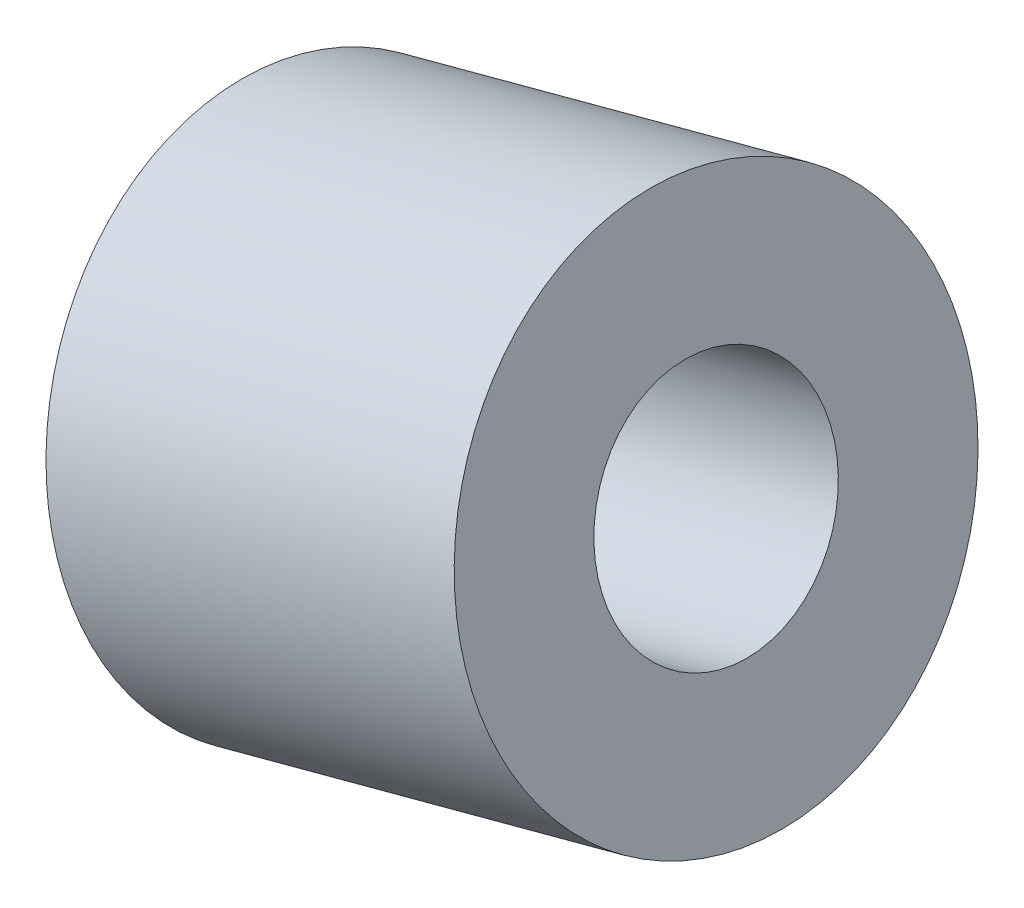
ISO-10303-21;
HEADER;
FILE_DESCRIPTION(('STEP AP214'),'2;1');
FILE_NAME('part.step','',(''),(''),'','','');
FILE_SCHEMA(('AUTOMOTIVE_DESIGN { 1 0 10303 214 1 1 1 1 }'));
ENDSEC;
DATA;
#1=APPLICATION_CONTEXT('core data for automotive mechanical design processes');
#2=APPLICATION_PROTOCOL_DEFINITION('international standard','automotive_design',2000,#1);
#3=PRODUCT_CONTEXT('',#1,'mechanical');
#4=PRODUCT('Part','Part','',(#3));
#5=PRODUCT_RELATED_PRODUCT_CATEGORY('part','',(#4));
#6=PRODUCT_DEFINITION_FORMATION('','',#4);
#7=PRODUCT_DEFINITION_CONTEXT('part definition',#1,'design');
#8=PRODUCT_DEFINITION('design','',#6,#7);
#9=PRODUCT_DEFINITION_SHAPE('','',#8);
#10=(LENGTH_UNIT() NAMED_UNIT(*) SI_UNIT(.MILLI.,.METRE.));
#11=(NAMED_UNIT(*) PLANE_ANGLE_UNIT() SI_UNIT($,.RADIAN.));
#12=(NAMED_UNIT(*) SI_UNIT($,.STERADIAN.) SOLID_ANGLE_UNIT());
#13=UNCERTAINTY_MEASURE_WITH_UNIT(LENGTH_MEASURE(1.E-05),#10,'distance_accuracy_value','');
#14=(GEOMETRIC_REPRESENTATION_CONTEXT(3) GLOBAL_UNCERTAINTY_ASSIGNED_CONTEXT((#13)) GLOBAL_UNIT_ASSIGNED_CONTEXT((#10,
#11,#12)) REPRESENTATION_CONTEXT('',''));
#15=CARTESIAN_POINT('',(0.,0.,0.));
#16=DIRECTION('',(0.,0.,1.));
#17=DIRECTION('',(1.,0.,0.));
#18=AXIS2_PLACEMENT_3D('',#15,#16,#17);
#19=CARTESIAN_POINT('',(-51.9867681997069,-48.929812556218,102.));
#20=DIRECTION('',(0.965925826289068,0.258819045102522,0.));
#21=DIRECTION('',(-0.258819045102522,0.965925826289068,0.));
#22=AXIS2_PLACEMENT_3D('',#19,#20,#21);
#23=CYLINDRICAL_SURFACE('',#22,7.);
#24=CARTESIAN_POINT('',(-51.9867681997069,-48.929812556218,102.));
#25=DIRECTION('',(-0.965925826289068,-0.258819045102522,0.));
#26=DIRECTION('',(0.258819045102522,-0.965925826289068,0.));
#27=AXIS2_PLACEMENT_3D('',#24,#25,#26);
#28=CIRCLE('',#27,7.);
#29=CARTESIAN_POINT('',(-50.1750348839892,-55.6912933402415,102.));
#30=VERTEX_POINT('',#29);
#31=EDGE_CURVE('E41',#30,#30,#28,.T.);
#32=ORIENTED_EDGE('',*,*,#31,.T.);
#33=EDGE_LOOP('',(#32));
#34=FACE_BOUND('',#33,.T.);
#35=CARTESIAN_POINT('',(-27.83862254248,-42.4593364286553,101.999999999999));
#36=DIRECTION('',(-0.965925826289068,-0.258819045102522,0.));
#37=DIRECTION('',(0.258819045102522,-0.965925826289068,0.));
#38=AXIS2_PLACEMENT_3D('',#35,#36,#37);
#39=CIRCLE('',#38,7.);
#40=CARTESIAN_POINT('',(-26.0268892267624,-49.2208172126787,102.));
#41=VERTEX_POINT('',#40);
#42=EDGE_CURVE('E47',#41,#41,#39,.T.);
#43=ORIENTED_EDGE('',*,*,#42,.F.);
#44=EDGE_LOOP('',(#43));
#45=FACE_BOUND('',#44,.T.);
#46=ADVANCED_FACE('F34',(#34,#45),#23,.F.);
#47=CARTESIAN_POINT('',(-51.9867681997069,-48.929812556218,102.));
#48=DIRECTION('',(0.965925826289068,0.258819045102522,0.));
#49=DIRECTION('',(-0.258819045102522,0.965925826289068,0.));
#50=AXIS2_PLACEMENT_3D('',#47,#48,#49);
#51=CYLINDRICAL_SURFACE('',#50,15.);
#52=CARTESIAN_POINT('',(-51.9867681997069,-48.929812556218,102.));
#53=DIRECTION('',(-0.965925826289068,-0.258819045102522,0.));
#54=DIRECTION('',(0.258819045102522,-0.965925826289068,0.));
#55=AXIS2_PLACEMENT_3D('',#52,#53,#54);
#56=CIRCLE('',#55,15.);
#57=CARTESIAN_POINT('',(-48.1044825231691,-63.418699950554,102.));
#58=VERTEX_POINT('',#57);
#59=EDGE_CURVE('E10',#58,#58,#56,.T.);
#60=ORIENTED_EDGE('',*,*,#59,.F.);
#61=EDGE_LOOP('',(#60));
#62=FACE_BOUND('',#61,.T.);
#63=CARTESIAN_POINT('',(-27.83862254248,-42.4593364286553,101.999999999999));
#64=DIRECTION('',(-0.965925826289068,-0.258819045102522,0.));
#65=DIRECTION('',(0.258819045102522,-0.965925826289068,0.));
#66=AXIS2_PLACEMENT_3D('',#63,#64,#65);
#67=CIRCLE('',#66,15.);
#68=CARTESIAN_POINT('',(-23.9563368659422,-56.9482238229913,102.));
#69=VERTEX_POINT('',#68);
#70=EDGE_CURVE('E37',#69,#69,#67,.T.);
#71=ORIENTED_EDGE('',*,*,#70,.T.);
#72=EDGE_LOOP('',(#71));
#73=FACE_BOUND('',#72,.T.);
#74=ADVANCED_FACE('F54',(#62,#73),#51,.T.);
#75=CARTESIAN_POINT('',(-51.9867681997069,-48.929812556218,102.));
#76=DIRECTION('',(-0.965925826289068,-0.258819045102522,0.));
#77=DIRECTION('',(0.258819045102522,-0.965925826289068,0.));
#78=AXIS2_PLACEMENT_3D('',#75,#76,#77);
#79=PLANE('',#78);
#80=ORIENTED_EDGE('',*,*,#31,.F.);
#81=EDGE_LOOP('',(#80));
#82=FACE_BOUND('',#81,.T.);
#83=ORIENTED_EDGE('',*,*,#59,.T.);
#84=EDGE_LOOP('',(#83));
#85=FACE_BOUND('',#84,.T.);
#86=ADVANCED_FACE('F58',(#82,#85),#79,.T.);
#87=CARTESIAN_POINT('',(-27.83862254248,-42.4593364286553,101.999999999999));
#88=DIRECTION('',(-0.965925826289068,-0.258819045102522,0.));
#89=DIRECTION('',(0.258819045102522,-0.965925826289068,0.));
#90=AXIS2_PLACEMENT_3D('',#87,#88,#89);
#91=PLANE('',#90);
#92=ORIENTED_EDGE('',*,*,#42,.T.);
#93=EDGE_LOOP('',(#92));
#94=FACE_BOUND('',#93,.T.);
#95=ORIENTED_EDGE('',*,*,#70,.F.);
#96=EDGE_LOOP('',(#95));
#97=FACE_BOUND('',#96,.T.);
#98=ADVANCED_FACE('F56',(#94,#97),#91,.F.);
#99=CLOSED_SHELL('',(#46,#74,#86,#98));
#100=MANIFOLD_SOLID_BREP('B2',#99);
#101=ADVANCED_BREP_SHAPE_REPRESENTATION('',(#18,#100),#14);
#102=SHAPE_DEFINITION_REPRESENTATION(#9,#101);
ENDSEC;
END-ISO-10303-21;
